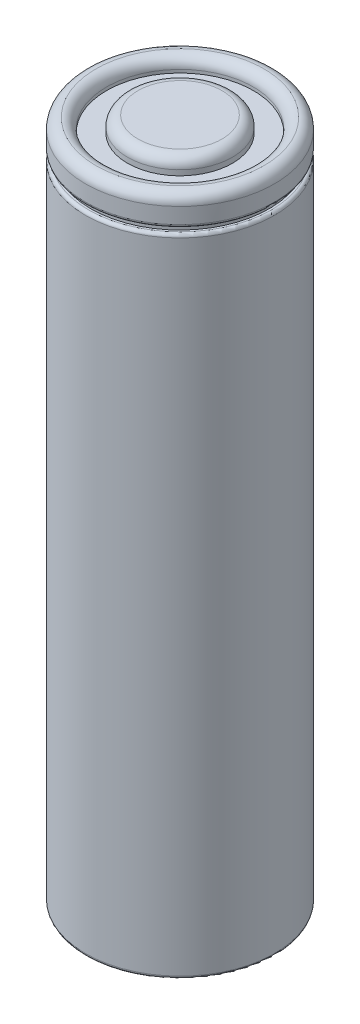
ISO-10303-21;
HEADER;
FILE_DESCRIPTION(('STEP AP214'),'2;1');
FILE_NAME('part.step','',(''),(''),'','','');
FILE_SCHEMA(('AUTOMOTIVE_DESIGN { 1 0 10303 214 1 1 1 1 }'));
ENDSEC;
DATA;
#1=APPLICATION_CONTEXT('core data for automotive mechanical design processes');
#2=APPLICATION_PROTOCOL_DEFINITION('international standard','automotive_design',2000,#1);
#3=PRODUCT_CONTEXT('',#1,'mechanical');
#4=PRODUCT('Part','Part','',(#3));
#5=PRODUCT_RELATED_PRODUCT_CATEGORY('part','',(#4));
#6=PRODUCT_DEFINITION_FORMATION('','',#4);
#7=PRODUCT_DEFINITION_CONTEXT('part definition',#1,'design');
#8=PRODUCT_DEFINITION('design','',#6,#7);
#9=PRODUCT_DEFINITION_SHAPE('','',#8);
#10=(LENGTH_UNIT() NAMED_UNIT(*) SI_UNIT(.MILLI.,.METRE.));
#11=(NAMED_UNIT(*) PLANE_ANGLE_UNIT() SI_UNIT($,.RADIAN.));
#12=(NAMED_UNIT(*) SI_UNIT($,.STERADIAN.) SOLID_ANGLE_UNIT());
#13=UNCERTAINTY_MEASURE_WITH_UNIT(LENGTH_MEASURE(1.E-05),#10,'distance_accuracy_value','');
#14=(GEOMETRIC_REPRESENTATION_CONTEXT(3) GLOBAL_UNCERTAINTY_ASSIGNED_CONTEXT((#13)) GLOBAL_UNIT_ASSIGNED_CONTEXT((#10,
#11,#12)) REPRESENTATION_CONTEXT('',''));
#15=CARTESIAN_POINT('',(0.,0.,0.));
#16=DIRECTION('',(0.,0.,1.));
#17=DIRECTION('',(1.,0.,0.));
#18=AXIS2_PLACEMENT_3D('',#15,#16,#17);
#19=CARTESIAN_POINT('',(0.,65.,0.));
#20=DIRECTION('',(0.,-1.,0.));
#21=DIRECTION('',(0.,0.,-1.));
#22=AXIS2_PLACEMENT_3D('',#19,#20,#21);
#23=CYLINDRICAL_SURFACE('',#22,9.00000000000001);
#24=CARTESIAN_POINT('',(0.,62.3,0.));
#25=DIRECTION('',(0.,-1.,0.));
#26=DIRECTION('',(0.,0.,-1.));
#27=AXIS2_PLACEMENT_3D('',#24,#25,#26);
#28=CIRCLE('',#27,9.00000000000001);
#29=CARTESIAN_POINT('',(0.,62.3,-9.00000000000001));
#30=VERTEX_POINT('',#29);
#31=EDGE_CURVE('E38',#30,#30,#28,.F.);
#32=ORIENTED_EDGE('',*,*,#31,.T.);
#33=EDGE_LOOP('',(#32));
#34=FACE_BOUND('',#33,.T.);
#35=CARTESIAN_POINT('',(0.,63.8,0.));
#36=DIRECTION('',(0.,1.,0.));
#37=DIRECTION('',(0.,0.,1.));
#38=AXIS2_PLACEMENT_3D('',#35,#36,#37);
#39=CIRCLE('',#38,9.00000000000001);
#40=CARTESIAN_POINT('',(0.,63.8,9.00000000000001));
#41=VERTEX_POINT('',#40);
#42=EDGE_CURVE('E57',#41,#41,#39,.F.);
#43=ORIENTED_EDGE('',*,*,#42,.T.);
#44=EDGE_LOOP('',(#43));
#45=FACE_BOUND('',#44,.T.);
#46=ADVANCED_FACE('F31',(#34,#45),#23,.T.);
#47=CARTESIAN_POINT('',(0.,65.,0.));
#48=DIRECTION('',(0.,1.,0.));
#49=DIRECTION('',(0.,0.,1.));
#50=AXIS2_PLACEMENT_3D('',#47,#48,#49);
#51=CYLINDRICAL_SURFACE('',#50,5.00000000000001);
#52=CARTESIAN_POINT('',(0.,64.,0.));
#53=DIRECTION('',(0.,1.,0.));
#54=DIRECTION('',(0.,0.,1.));
#55=AXIS2_PLACEMENT_3D('',#52,#53,#54);
#56=CIRCLE('',#55,5.00000000000001);
#57=CARTESIAN_POINT('',(0.,64.,5.00000000000001));
#58=VERTEX_POINT('',#57);
#59=EDGE_CURVE('E67',#58,#58,#56,.F.);
#60=ORIENTED_EDGE('',*,*,#59,.T.);
#61=EDGE_LOOP('',(#60));
#62=FACE_BOUND('',#61,.T.);
#63=CARTESIAN_POINT('',(0.,63.5,0.));
#64=DIRECTION('',(0.,1.,0.));
#65=DIRECTION('',(0.,0.,1.));
#66=AXIS2_PLACEMENT_3D('',#63,#64,#65);
#67=CIRCLE('',#66,5.00000000000001);
#68=CARTESIAN_POINT('',(0.,63.5,5.00000000000001));
#69=VERTEX_POINT('',#68);
#70=EDGE_CURVE('E73',#69,#69,#67,.T.);
#71=ORIENTED_EDGE('',*,*,#70,.T.);
#72=EDGE_LOOP('',(#71));
#73=FACE_BOUND('',#72,.T.);
#74=ADVANCED_FACE('F104',(#62,#73),#51,.T.);
#75=CARTESIAN_POINT('',(5.00000000000001,63.5,0.));
#76=DIRECTION('',(0.,1.,0.));
#77=DIRECTION('',(0.,0.,1.));
#78=AXIS2_PLACEMENT_3D('',#75,#76,#77);
#79=PLANE('',#78);
#80=CARTESIAN_POINT('',(0.,63.5,0.));
#81=DIRECTION('',(0.,1.,0.));
#82=DIRECTION('',(0.,0.,1.));
#83=AXIS2_PLACEMENT_3D('',#80,#81,#82);
#84=CIRCLE('',#83,7.00000000000001);
#85=CARTESIAN_POINT('',(0.,63.5,7.00000000000001));
#86=VERTEX_POINT('',#85);
#87=EDGE_CURVE('E76',#86,#86,#84,.T.);
#88=ORIENTED_EDGE('',*,*,#87,.T.);
#89=EDGE_LOOP('',(#88));
#90=FACE_BOUND('',#89,.T.);
#91=ORIENTED_EDGE('',*,*,#70,.F.);
#92=EDGE_LOOP('',(#91));
#93=FACE_BOUND('',#92,.T.);
#94=ADVANCED_FACE('F110',(#90,#93),#79,.T.);
#95=CARTESIAN_POINT('',(0.,65.,0.));
#96=DIRECTION('',(0.,1.,0.));
#97=DIRECTION('',(0.,0.,1.));
#98=AXIS2_PLACEMENT_3D('',#95,#96,#97);
#99=CYLINDRICAL_SURFACE('',#98,7.00000000000001);
#100=CARTESIAN_POINT('',(0.,63.8,0.));
#101=DIRECTION('',(0.,1.,0.));
#102=DIRECTION('',(0.,0.,1.));
#103=AXIS2_PLACEMENT_3D('',#100,#101,#102);
#104=CIRCLE('',#103,7.00000000000001);
#105=CARTESIAN_POINT('',(0.,63.8,7.00000000000001));
#106=VERTEX_POINT('',#105);
#107=EDGE_CURVE('E64',#106,#106,#104,.T.);
#108=ORIENTED_EDGE('',*,*,#107,.T.);
#109=EDGE_LOOP('',(#108));
#110=FACE_BOUND('',#109,.T.);
#111=ORIENTED_EDGE('',*,*,#87,.F.);
#112=EDGE_LOOP('',(#111));
#113=FACE_BOUND('',#112,.T.);
#114=ADVANCED_FACE('F99',(#110,#113),#99,.F.);
#115=CARTESIAN_POINT('',(0.,65.,0.));
#116=DIRECTION('',(0.,1.,0.));
#117=DIRECTION('',(0.,0.,1.));
#118=AXIS2_PLACEMENT_3D('',#115,#116,#117);
#119=PLANE('',#118);
#120=CARTESIAN_POINT('',(0.,65.,0.));
#121=DIRECTION('',(0.,1.,0.));
#122=DIRECTION('',(0.,0.,1.));
#123=AXIS2_PLACEMENT_3D('',#120,#121,#122);
#124=CIRCLE('',#123,4.00000000000001);
#125=CARTESIAN_POINT('',(0.,65.,4.00000000000001));
#126=VERTEX_POINT('',#125);
#127=EDGE_CURVE('E70',#126,#126,#124,.T.);
#128=ORIENTED_EDGE('',*,*,#127,.T.);
#129=EDGE_LOOP('',(#128));
#130=FACE_BOUND('',#129,.T.);
#131=ADVANCED_FACE('F90',(#130),#119,.T.);
#132=CARTESIAN_POINT('',(0.,65.,0.));
#133=DIRECTION('',(0.,1.,0.));
#134=DIRECTION('',(0.,0.,1.));
#135=AXIS2_PLACEMENT_3D('',#132,#133,#134);
#136=CYLINDRICAL_SURFACE('',#135,8.50000000000001);
#137=CARTESIAN_POINT('',(0.,61.5,0.));
#138=DIRECTION('',(0.,1.,0.));
#139=DIRECTION('',(0.,0.,1.));
#140=AXIS2_PLACEMENT_3D('',#137,#138,#139);
#141=CIRCLE('',#140,8.50000000000001);
#142=CARTESIAN_POINT('',(0.,61.5,8.50000000000001));
#143=VERTEX_POINT('',#142);
#144=EDGE_CURVE('E79',#143,#143,#141,.T.);
#145=ORIENTED_EDGE('',*,*,#144,.T.);
#146=EDGE_LOOP('',(#145));
#147=FACE_BOUND('',#146,.T.);
#148=CARTESIAN_POINT('',(0.,62.,0.));
#149=DIRECTION('',(0.,1.,0.));
#150=DIRECTION('',(0.,0.,1.));
#151=AXIS2_PLACEMENT_3D('',#148,#149,#150);
#152=CIRCLE('',#151,8.50000000000001);
#153=CARTESIAN_POINT('',(0.,62.,8.50000000000001));
#154=VERTEX_POINT('',#153);
#155=EDGE_CURVE('E61',#154,#154,#152,.T.);
#156=ORIENTED_EDGE('',*,*,#155,.F.);
#157=EDGE_LOOP('',(#156));
#158=FACE_BOUND('',#157,.T.);
#159=ADVANCED_FACE('F87',(#147,#158),#136,.T.);
#160=CARTESIAN_POINT('',(8.50000000000001,61.5,0.));
#161=DIRECTION('',(0.,1.,0.));
#162=DIRECTION('',(0.,0.,1.));
#163=AXIS2_PLACEMENT_3D('',#160,#161,#162);
#164=PLANE('',#163);
#165=CARTESIAN_POINT('',(0.,61.5,0.));
#166=DIRECTION('',(0.,1.,0.));
#167=DIRECTION('',(0.,0.,1.));
#168=AXIS2_PLACEMENT_3D('',#165,#166,#167);
#169=CIRCLE('',#168,8.70000000000001);
#170=CARTESIAN_POINT('',(0.,61.5,8.70000000000001));
#171=VERTEX_POINT('',#170);
#172=EDGE_CURVE('E42',#171,#171,#169,.T.);
#173=ORIENTED_EDGE('',*,*,#172,.T.);
#174=EDGE_LOOP('',(#173));
#175=FACE_BOUND('',#174,.T.);
#176=ORIENTED_EDGE('',*,*,#144,.F.);
#177=EDGE_LOOP('',(#176));
#178=FACE_BOUND('',#177,.T.);
#179=ADVANCED_FACE('F89',(#175,#178),#164,.T.);
#180=CARTESIAN_POINT('',(8.50000000000001,62.,0.));
#181=DIRECTION('',(0.,-1.,0.));
#182=DIRECTION('',(0.,0.,-1.));
#183=AXIS2_PLACEMENT_3D('',#180,#181,#182);
#184=PLANE('',#183);
#185=CARTESIAN_POINT('',(0.,62.,0.));
#186=DIRECTION('',(0.,-1.,0.));
#187=DIRECTION('',(0.,0.,-1.));
#188=AXIS2_PLACEMENT_3D('',#185,#186,#187);
#189=CIRCLE('',#188,8.70000000000001);
#190=CARTESIAN_POINT('',(0.,62.,-8.70000000000001));
#191=VERTEX_POINT('',#190);
#192=EDGE_CURVE('E10',#191,#191,#189,.T.);
#193=ORIENTED_EDGE('',*,*,#192,.T.);
#194=EDGE_LOOP('',(#193));
#195=FACE_BOUND('',#194,.T.);
#196=ORIENTED_EDGE('',*,*,#155,.T.);
#197=EDGE_LOOP('',(#196));
#198=FACE_BOUND('',#197,.T.);
#199=ADVANCED_FACE('F85',(#195,#198),#184,.T.);
#200=CARTESIAN_POINT('',(0.,0.,0.));
#201=DIRECTION('',(0.,1.,0.));
#202=DIRECTION('',(0.,0.,1.));
#203=AXIS2_PLACEMENT_3D('',#200,#201,#202);
#204=PLANE('',#203);
#205=CARTESIAN_POINT('',(0.,0.,0.));
#206=DIRECTION('',(0.,1.,0.));
#207=DIRECTION('',(0.,0.,1.));
#208=AXIS2_PLACEMENT_3D('',#205,#206,#207);
#209=CIRCLE('',#208,8.70000000000001);
#210=CARTESIAN_POINT('',(0.,0.,8.70000000000001));
#211=VERTEX_POINT('',#210);
#212=EDGE_CURVE('E46',#211,#211,#209,.F.);
#213=ORIENTED_EDGE('',*,*,#212,.T.);
#214=EDGE_LOOP('',(#213));
#215=FACE_BOUND('',#214,.T.);
#216=ADVANCED_FACE('F118',(#215),#204,.F.);
#217=CARTESIAN_POINT('',(0.,0.299999999999995,0.));
#218=DIRECTION('',(0.,1.,0.));
#219=DIRECTION('',(0.,0.,1.));
#220=AXIS2_PLACEMENT_3D('',#217,#218,#219);
#221=CIRCLE('',#220,9.00000000000001);
#222=CARTESIAN_POINT('',(0.,0.299999999999995,9.00000000000001));
#223=VERTEX_POINT('',#222);
#224=EDGE_CURVE('E51',#223,#223,#221,.T.);
#225=ORIENTED_EDGE('',*,*,#224,.T.);
#226=EDGE_LOOP('',(#225));
#227=FACE_BOUND('',#226,.T.);
#228=CARTESIAN_POINT('',(0.,61.2,0.));
#229=DIRECTION('',(0.,1.,0.));
#230=DIRECTION('',(0.,0.,1.));
#231=AXIS2_PLACEMENT_3D('',#228,#229,#230);
#232=CIRCLE('',#231,9.00000000000001);
#233=CARTESIAN_POINT('',(0.,61.2,9.00000000000001));
#234=VERTEX_POINT('',#233);
#235=EDGE_CURVE('E54',#234,#234,#232,.F.);
#236=ORIENTED_EDGE('',*,*,#235,.T.);
#237=EDGE_LOOP('',(#236));
#238=FACE_BOUND('',#237,.T.);
#239=ADVANCED_FACE('F106',(#227,#238),#23,.T.);
#240=CARTESIAN_POINT('',(0.,64.,0.));
#241=DIRECTION('',(0.,1.,0.));
#242=DIRECTION('',(0.,0.,1.));
#243=AXIS2_PLACEMENT_3D('',#240,#241,#242);
#244=TOROIDAL_SURFACE('',#243,4.00000000000001,1.);
#245=ORIENTED_EDGE('',*,*,#59,.F.);
#246=EDGE_LOOP('',(#245));
#247=FACE_BOUND('',#246,.T.);
#248=ORIENTED_EDGE('',*,*,#127,.F.);
#249=EDGE_LOOP('',(#248));
#250=FACE_BOUND('',#249,.T.);
#251=ADVANCED_FACE('F117',(#247,#250),#244,.T.);
#252=CARTESIAN_POINT('',(0.,63.8,0.));
#253=DIRECTION('',(0.,1.,0.));
#254=DIRECTION('',(0.,0.,1.));
#255=AXIS2_PLACEMENT_3D('',#252,#253,#254);
#256=TOROIDAL_SURFACE('',#255,8.00000000000001,1.);
#257=ORIENTED_EDGE('',*,*,#42,.F.);
#258=EDGE_LOOP('',(#257));
#259=FACE_BOUND('',#258,.T.);
#260=CARTESIAN_POINT('',(0.,64.8,0.));
#261=DIRECTION('',(0.,1.,0.));
#262=DIRECTION('',(0.,0.,1.));
#263=AXIS2_PLACEMENT_3D('',#260,#261,#262);
#264=CIRCLE('',#263,8.00000000000001);
#265=CARTESIAN_POINT('',(0.,64.8,8.00000000000001));
#266=VERTEX_POINT('',#265);
#267=EDGE_CURVE('E58',#266,#266,#264,.T.);
#268=ORIENTED_EDGE('',*,*,#267,.F.);
#269=EDGE_LOOP('',(#268));
#270=FACE_BOUND('',#269,.T.);
#271=ADVANCED_FACE('F124',(#259,#270),#256,.T.);
#272=CARTESIAN_POINT('',(0.,63.8,0.));
#273=DIRECTION('',(0.,1.,0.));
#274=DIRECTION('',(0.,0.,1.));
#275=AXIS2_PLACEMENT_3D('',#272,#273,#274);
#276=TOROIDAL_SURFACE('',#275,8.00000000000001,1.);
#277=ORIENTED_EDGE('',*,*,#267,.T.);
#278=EDGE_LOOP('',(#277));
#279=FACE_BOUND('',#278,.T.);
#280=ORIENTED_EDGE('',*,*,#107,.F.);
#281=EDGE_LOOP('',(#280));
#282=FACE_BOUND('',#281,.T.);
#283=ADVANCED_FACE('F143',(#279,#282),#276,.T.);
#284=CARTESIAN_POINT('',(0.,0.299999999999995,0.));
#285=DIRECTION('',(0.,1.,0.));
#286=DIRECTION('',(0.,0.,1.));
#287=AXIS2_PLACEMENT_3D('',#284,#285,#286);
#288=TOROIDAL_SURFACE('',#287,8.70000000000001,0.3);
#289=ORIENTED_EDGE('',*,*,#212,.F.);
#290=EDGE_LOOP('',(#289));
#291=FACE_BOUND('',#290,.T.);
#292=ORIENTED_EDGE('',*,*,#224,.F.);
#293=EDGE_LOOP('',(#292));
#294=FACE_BOUND('',#293,.T.);
#295=ADVANCED_FACE('F134',(#291,#294),#288,.T.);
#296=CARTESIAN_POINT('',(0.,61.2,0.));
#297=DIRECTION('',(0.,1.,0.));
#298=DIRECTION('',(0.,0.,1.));
#299=AXIS2_PLACEMENT_3D('',#296,#297,#298);
#300=TOROIDAL_SURFACE('',#299,8.70000000000001,0.3);
#301=ORIENTED_EDGE('',*,*,#235,.F.);
#302=EDGE_LOOP('',(#301));
#303=FACE_BOUND('',#302,.T.);
#304=ORIENTED_EDGE('',*,*,#172,.F.);
#305=EDGE_LOOP('',(#304));
#306=FACE_BOUND('',#305,.T.);
#307=ADVANCED_FACE('F131',(#303,#306),#300,.T.);
#308=CARTESIAN_POINT('',(0.,62.3,0.));
#309=DIRECTION('',(0.,-1.,0.));
#310=DIRECTION('',(0.,0.,-1.));
#311=AXIS2_PLACEMENT_3D('',#308,#309,#310);
#312=TOROIDAL_SURFACE('',#311,8.70000000000001,0.3);
#313=ORIENTED_EDGE('',*,*,#192,.F.);
#314=EDGE_LOOP('',(#313));
#315=FACE_BOUND('',#314,.T.);
#316=ORIENTED_EDGE('',*,*,#31,.F.);
#317=EDGE_LOOP('',(#316));
#318=FACE_BOUND('',#317,.T.);
#319=ADVANCED_FACE('F33',(#315,#318),#312,.T.);
#320=CLOSED_SHELL('',(#46,#74,#94,#114,#131,#159,#179,#199,#216,#239,#251,#271,#283,#295,#307,#319));
#321=MANIFOLD_SOLID_BREP('B2',#320);
#322=ADVANCED_BREP_SHAPE_REPRESENTATION('',(#18,#321),#14);
#323=SHAPE_DEFINITION_REPRESENTATION(#9,#322);
ENDSEC;
END-ISO-10303-21;
